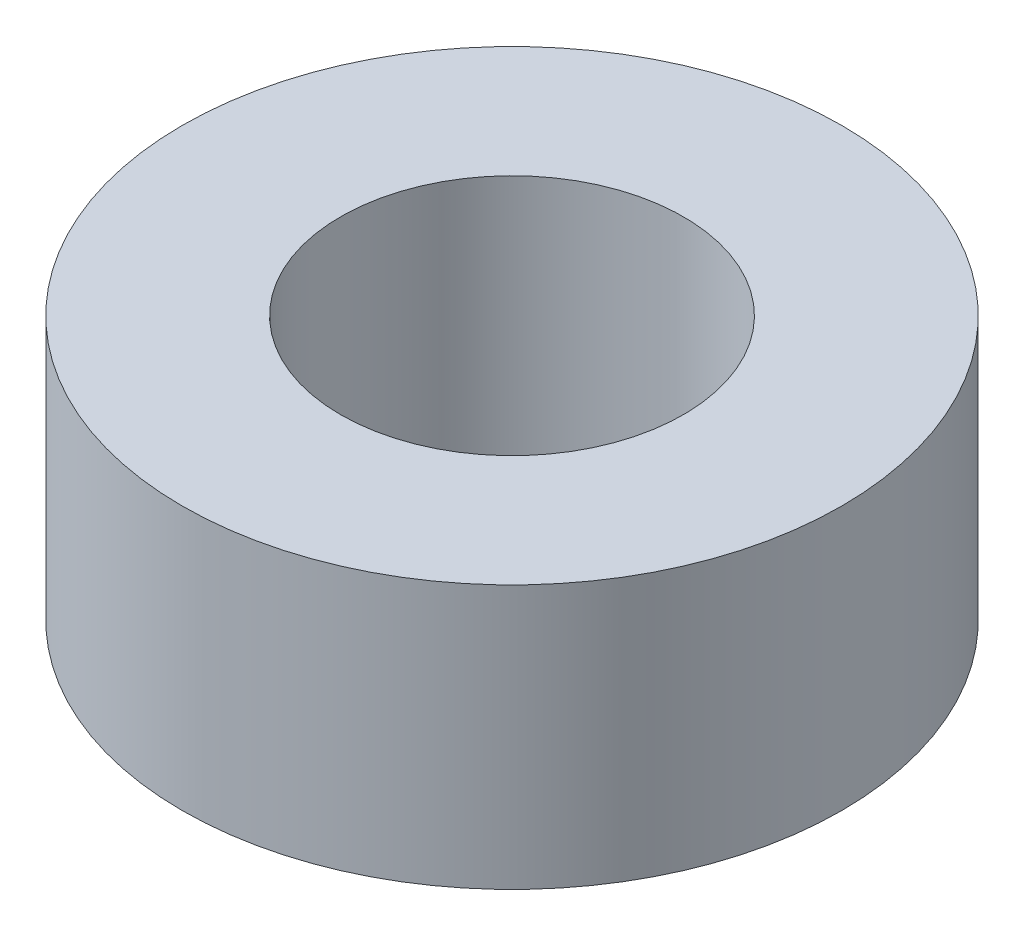
ISO-10303-21;
HEADER;
FILE_DESCRIPTION(('STEP AP214'),'2;1');
FILE_NAME('part.step','',(''),(''),'','','');
FILE_SCHEMA(('AUTOMOTIVE_DESIGN { 1 0 10303 214 1 1 1 1 }'));
ENDSEC;
DATA;
#1=APPLICATION_CONTEXT('core data for automotive mechanical design processes');
#2=APPLICATION_PROTOCOL_DEFINITION('international standard','automotive_design',2000,#1);
#3=PRODUCT_CONTEXT('',#1,'mechanical');
#4=PRODUCT('Part','Part','',(#3));
#5=PRODUCT_RELATED_PRODUCT_CATEGORY('part','',(#4));
#6=PRODUCT_DEFINITION_FORMATION('','',#4);
#7=PRODUCT_DEFINITION_CONTEXT('part definition',#1,'design');
#8=PRODUCT_DEFINITION('design','',#6,#7);
#9=PRODUCT_DEFINITION_SHAPE('','',#8);
#10=(LENGTH_UNIT() NAMED_UNIT(*) SI_UNIT(.MILLI.,.METRE.));
#11=(NAMED_UNIT(*) PLANE_ANGLE_UNIT() SI_UNIT($,.RADIAN.));
#12=(NAMED_UNIT(*) SI_UNIT($,.STERADIAN.) SOLID_ANGLE_UNIT());
#13=UNCERTAINTY_MEASURE_WITH_UNIT(LENGTH_MEASURE(1.E-05),#10,'distance_accuracy_value','');
#14=(GEOMETRIC_REPRESENTATION_CONTEXT(3) GLOBAL_UNCERTAINTY_ASSIGNED_CONTEXT((#13)) GLOBAL_UNIT_ASSIGNED_CONTEXT((#10,
#11,#12)) REPRESENTATION_CONTEXT('',''));
#15=CARTESIAN_POINT('',(0.,0.,0.));
#16=DIRECTION('',(0.,0.,1.));
#17=DIRECTION('',(1.,0.,0.));
#18=AXIS2_PLACEMENT_3D('',#15,#16,#17);
#19=CARTESIAN_POINT('',(0.,5.08,0.));
#20=DIRECTION('',(0.,1.,0.));
#21=DIRECTION('',(0.,0.,1.));
#22=AXIS2_PLACEMENT_3D('',#19,#20,#21);
#23=PLANE('',#22);
#24=CARTESIAN_POINT('',(0.,5.08,0.));
#25=DIRECTION('',(0.,1.,0.));
#26=DIRECTION('',(0.,0.,1.));
#27=AXIS2_PLACEMENT_3D('',#24,#25,#26);
#28=CIRCLE('',#27,6.35);
#29=CARTESIAN_POINT('',(0.,5.08,6.35));
#30=VERTEX_POINT('',#29);
#31=EDGE_CURVE('E10',#30,#30,#28,.T.);
#32=ORIENTED_EDGE('',*,*,#31,.T.);
#33=EDGE_LOOP('',(#32));
#34=FACE_BOUND('',#33,.T.);
#35=CARTESIAN_POINT('',(0.,5.08,0.));
#36=DIRECTION('',(0.,1.,0.));
#37=DIRECTION('',(0.,0.,1.));
#38=AXIS2_PLACEMENT_3D('',#35,#36,#37);
#39=CIRCLE('',#38,3.302);
#40=CARTESIAN_POINT('',(0.,5.08,3.302));
#41=VERTEX_POINT('',#40);
#42=EDGE_CURVE('E42',#41,#41,#39,.T.);
#43=ORIENTED_EDGE('',*,*,#42,.F.);
#44=EDGE_LOOP('',(#43));
#45=FACE_BOUND('',#44,.T.);
#46=ADVANCED_FACE('F31',(#34,#45),#23,.T.);
#47=CARTESIAN_POINT('',(0.,0.,0.));
#48=DIRECTION('',(0.,1.,0.));
#49=DIRECTION('',(0.,0.,1.));
#50=AXIS2_PLACEMENT_3D('',#47,#48,#49);
#51=PLANE('',#50);
#52=CARTESIAN_POINT('',(0.,0.,0.));
#53=DIRECTION('',(0.,1.,0.));
#54=DIRECTION('',(0.,0.,1.));
#55=AXIS2_PLACEMENT_3D('',#52,#53,#54);
#56=CIRCLE('',#55,6.35);
#57=CARTESIAN_POINT('',(0.,0.,6.35));
#58=VERTEX_POINT('',#57);
#59=EDGE_CURVE('E35',#58,#58,#56,.T.);
#60=ORIENTED_EDGE('',*,*,#59,.F.);
#61=EDGE_LOOP('',(#60));
#62=FACE_BOUND('',#61,.T.);
#63=CARTESIAN_POINT('',(0.,0.,0.));
#64=DIRECTION('',(0.,1.,0.));
#65=DIRECTION('',(0.,0.,1.));
#66=AXIS2_PLACEMENT_3D('',#63,#64,#65);
#67=CIRCLE('',#66,3.302);
#68=CARTESIAN_POINT('',(0.,0.,3.302));
#69=VERTEX_POINT('',#68);
#70=EDGE_CURVE('E44',#69,#69,#67,.T.);
#71=ORIENTED_EDGE('',*,*,#70,.T.);
#72=EDGE_LOOP('',(#71));
#73=FACE_BOUND('',#72,.T.);
#74=ADVANCED_FACE('F54',(#62,#73),#51,.F.);
#75=CARTESIAN_POINT('',(0.,5.08,0.));
#76=DIRECTION('',(0.,-1.,0.));
#77=DIRECTION('',(0.,0.,-1.));
#78=AXIS2_PLACEMENT_3D('',#75,#76,#77);
#79=CYLINDRICAL_SURFACE('',#78,6.35);
#80=ORIENTED_EDGE('',*,*,#31,.F.);
#81=EDGE_LOOP('',(#80));
#82=FACE_BOUND('',#81,.T.);
#83=ORIENTED_EDGE('',*,*,#59,.T.);
#84=EDGE_LOOP('',(#83));
#85=FACE_BOUND('',#84,.T.);
#86=ADVANCED_FACE('F33',(#82,#85),#79,.T.);
#87=CARTESIAN_POINT('',(0.,5.08,0.));
#88=DIRECTION('',(0.,-1.,0.));
#89=DIRECTION('',(0.,0.,-1.));
#90=AXIS2_PLACEMENT_3D('',#87,#88,#89);
#91=CYLINDRICAL_SURFACE('',#90,3.302);
#92=ORIENTED_EDGE('',*,*,#42,.T.);
#93=EDGE_LOOP('',(#92));
#94=FACE_BOUND('',#93,.T.);
#95=ORIENTED_EDGE('',*,*,#70,.F.);
#96=EDGE_LOOP('',(#95));
#97=FACE_BOUND('',#96,.T.);
#98=ADVANCED_FACE('F50',(#94,#97),#91,.F.);
#99=CLOSED_SHELL('',(#46,#74,#86,#98));
#100=MANIFOLD_SOLID_BREP('B2',#99);
#101=ADVANCED_BREP_SHAPE_REPRESENTATION('',(#18,#100),#14);
#102=SHAPE_DEFINITION_REPRESENTATION(#9,#101);
ENDSEC;
END-ISO-10303-21;
